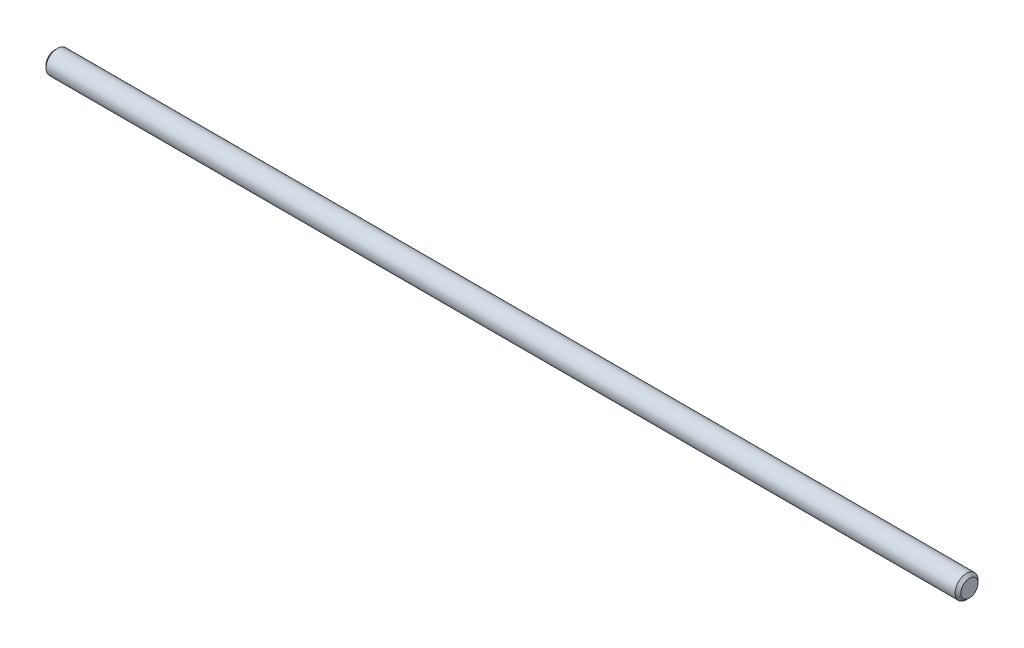
ISO-10303-21;
HEADER;
FILE_DESCRIPTION(('STEP AP214'),'2;1');
FILE_NAME('part.step','',(''),(''),'','','');
FILE_SCHEMA(('AUTOMOTIVE_DESIGN { 1 0 10303 214 1 1 1 1 }'));
ENDSEC;
DATA;
#1=APPLICATION_CONTEXT('core data for automotive mechanical design processes');
#2=APPLICATION_PROTOCOL_DEFINITION('international standard','automotive_design',2000,#1);
#3=PRODUCT_CONTEXT('',#1,'mechanical');
#4=PRODUCT('Part','Part','',(#3));
#5=PRODUCT_RELATED_PRODUCT_CATEGORY('part','',(#4));
#6=PRODUCT_DEFINITION_FORMATION('','',#4);
#7=PRODUCT_DEFINITION_CONTEXT('part definition',#1,'design');
#8=PRODUCT_DEFINITION('design','',#6,#7);
#9=PRODUCT_DEFINITION_SHAPE('','',#8);
#10=(LENGTH_UNIT() NAMED_UNIT(*) SI_UNIT(.MILLI.,.METRE.));
#11=(NAMED_UNIT(*) PLANE_ANGLE_UNIT() SI_UNIT($,.RADIAN.));
#12=(NAMED_UNIT(*) SI_UNIT($,.STERADIAN.) SOLID_ANGLE_UNIT());
#13=UNCERTAINTY_MEASURE_WITH_UNIT(LENGTH_MEASURE(1.E-05),#10,'distance_accuracy_value','');
#14=(GEOMETRIC_REPRESENTATION_CONTEXT(3) GLOBAL_UNCERTAINTY_ASSIGNED_CONTEXT((#13)) GLOBAL_UNIT_ASSIGNED_CONTEXT((#10,
#11,#12)) REPRESENTATION_CONTEXT('',''));
#15=CARTESIAN_POINT('',(0.,0.,0.));
#16=DIRECTION('',(0.,0.,1.));
#17=DIRECTION('',(1.,0.,0.));
#18=AXIS2_PLACEMENT_3D('',#15,#16,#17);
#19=CARTESIAN_POINT('',(-60.,0.,0.));
#20=DIRECTION('',(1.,0.,0.));
#21=DIRECTION('',(0.,0.,-1.));
#22=AXIS2_PLACEMENT_3D('',#19,#20,#21);
#23=CYLINDRICAL_SURFACE('',#22,1.5);
#24=CARTESIAN_POINT('',(-59.625,0.,0.));
#25=DIRECTION('',(1.,0.,0.));
#26=DIRECTION('',(0.,0.,-1.));
#27=AXIS2_PLACEMENT_3D('',#24,#25,#26);
#28=CIRCLE('',#27,1.5);
#29=CARTESIAN_POINT('',(-59.625,0.,-1.5));
#30=VERTEX_POINT('',#29);
#31=EDGE_CURVE('E41',#30,#30,#28,.T.);
#32=ORIENTED_EDGE('',*,*,#31,.T.);
#33=EDGE_LOOP('',(#32));
#34=FACE_BOUND('',#33,.T.);
#35=CARTESIAN_POINT('',(59.625,0.,0.));
#36=DIRECTION('',(1.,0.,0.));
#37=DIRECTION('',(0.,0.,-1.));
#38=AXIS2_PLACEMENT_3D('',#35,#36,#37);
#39=CIRCLE('',#38,1.5);
#40=CARTESIAN_POINT('',(59.625,0.,-1.5));
#41=VERTEX_POINT('',#40);
#42=EDGE_CURVE('E45',#41,#41,#39,.F.);
#43=ORIENTED_EDGE('',*,*,#42,.T.);
#44=EDGE_LOOP('',(#43));
#45=FACE_BOUND('',#44,.T.);
#46=ADVANCED_FACE('F30',(#34,#45),#23,.T.);
#47=CARTESIAN_POINT('',(-60.,0.,0.));
#48=DIRECTION('',(1.,0.,0.));
#49=DIRECTION('',(0.,0.,-1.));
#50=AXIS2_PLACEMENT_3D('',#47,#48,#49);
#51=PLANE('',#50);
#52=CARTESIAN_POINT('',(-60.,0.,0.));
#53=DIRECTION('',(1.,0.,0.));
#54=DIRECTION('',(0.,0.,-1.));
#55=AXIS2_PLACEMENT_3D('',#52,#53,#54);
#56=CIRCLE('',#55,1.12499999999999);
#57=CARTESIAN_POINT('',(-60.,0.,-1.12499999999999));
#58=VERTEX_POINT('',#57);
#59=EDGE_CURVE('E37',#58,#58,#56,.F.);
#60=ORIENTED_EDGE('',*,*,#59,.T.);
#61=EDGE_LOOP('',(#60));
#62=FACE_BOUND('',#61,.T.);
#63=ADVANCED_FACE('F61',(#62),#51,.F.);
#64=CARTESIAN_POINT('',(60.,0.,0.));
#65=DIRECTION('',(1.,0.,0.));
#66=DIRECTION('',(0.,0.,-1.));
#67=AXIS2_PLACEMENT_3D('',#64,#65,#66);
#68=PLANE('',#67);
#69=CARTESIAN_POINT('',(60.,0.,0.));
#70=DIRECTION('',(1.,0.,0.));
#71=DIRECTION('',(0.,0.,-1.));
#72=AXIS2_PLACEMENT_3D('',#69,#70,#71);
#73=CIRCLE('',#72,1.12500000000001);
#74=CARTESIAN_POINT('',(60.,0.,-1.12500000000001));
#75=VERTEX_POINT('',#74);
#76=EDGE_CURVE('E10',#75,#75,#73,.T.);
#77=ORIENTED_EDGE('',*,*,#76,.T.);
#78=EDGE_LOOP('',(#77));
#79=FACE_BOUND('',#78,.T.);
#80=ADVANCED_FACE('F58',(#79),#68,.T.);
#81=CARTESIAN_POINT('',(-59.625,0.,0.));
#82=DIRECTION('',(1.,0.,0.));
#83=DIRECTION('',(0.,0.,-1.));
#84=AXIS2_PLACEMENT_3D('',#81,#82,#83);
#85=CONICAL_SURFACE('',#84,1.5,0.785398163397456);
#86=ORIENTED_EDGE('',*,*,#59,.F.);
#87=EDGE_LOOP('',(#86));
#88=FACE_BOUND('',#87,.T.);
#89=ORIENTED_EDGE('',*,*,#31,.F.);
#90=EDGE_LOOP('',(#89));
#91=FACE_BOUND('',#90,.T.);
#92=ADVANCED_FACE('F54',(#88,#91),#85,.T.);
#93=CARTESIAN_POINT('',(60.,0.,0.));
#94=DIRECTION('',(-1.,0.,0.));
#95=DIRECTION('',(0.,0.,1.));
#96=AXIS2_PLACEMENT_3D('',#93,#94,#95);
#97=CONICAL_SURFACE('',#96,1.12500000000001,0.785398163397447);
#98=ORIENTED_EDGE('',*,*,#42,.F.);
#99=EDGE_LOOP('',(#98));
#100=FACE_BOUND('',#99,.T.);
#101=ORIENTED_EDGE('',*,*,#76,.F.);
#102=EDGE_LOOP('',(#101));
#103=FACE_BOUND('',#102,.T.);
#104=ADVANCED_FACE('F32',(#100,#103),#97,.T.);
#105=CLOSED_SHELL('',(#46,#63,#80,#92,#104));
#106=MANIFOLD_SOLID_BREP('B2',#105);
#107=ADVANCED_BREP_SHAPE_REPRESENTATION('',(#18,#106),#14);
#108=SHAPE_DEFINITION_REPRESENTATION(#9,#107);
ENDSEC;
END-ISO-10303-21;
